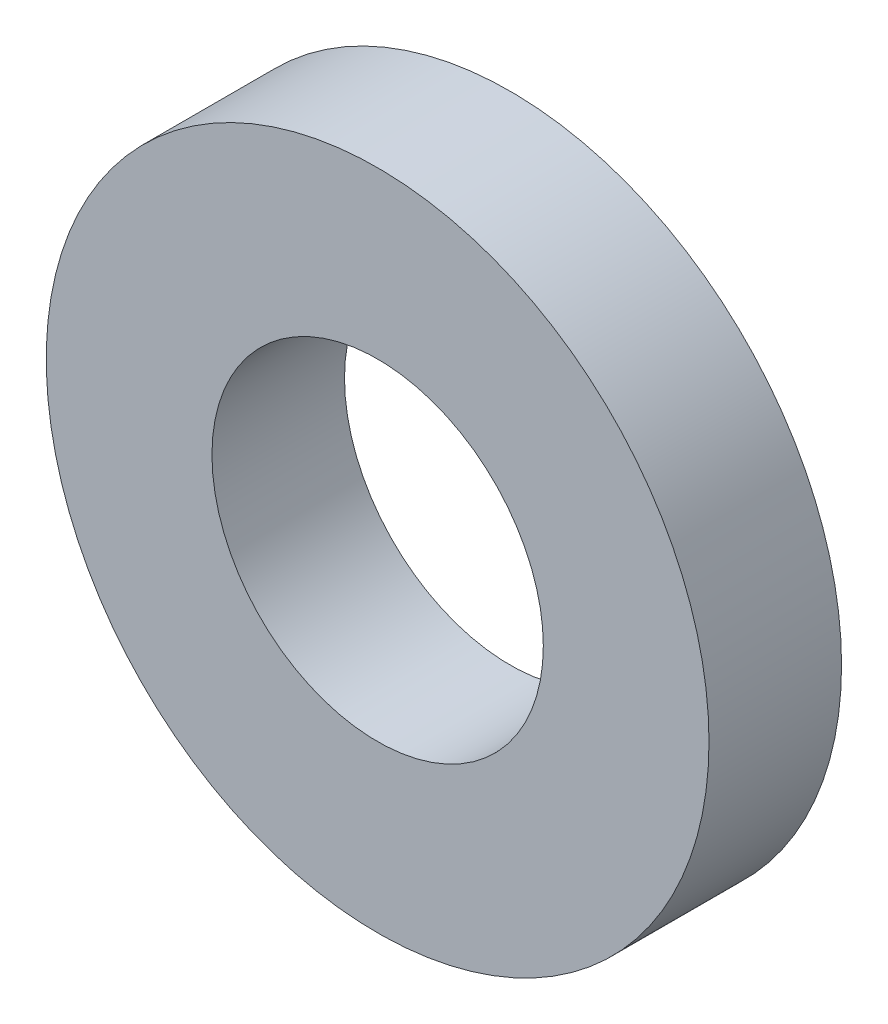
ISO-10303-21;
HEADER;
FILE_DESCRIPTION(('STEP AP214'),'2;1');
FILE_NAME('part.step','',(''),(''),'','','');
FILE_SCHEMA(('AUTOMOTIVE_DESIGN { 1 0 10303 214 1 1 1 1 }'));
ENDSEC;
DATA;
#1=APPLICATION_CONTEXT('core data for automotive mechanical design processes');
#2=APPLICATION_PROTOCOL_DEFINITION('international standard','automotive_design',2000,#1);
#3=PRODUCT_CONTEXT('',#1,'mechanical');
#4=PRODUCT('Part','Part','',(#3));
#5=PRODUCT_RELATED_PRODUCT_CATEGORY('part','',(#4));
#6=PRODUCT_DEFINITION_FORMATION('','',#4);
#7=PRODUCT_DEFINITION_CONTEXT('part definition',#1,'design');
#8=PRODUCT_DEFINITION('design','',#6,#7);
#9=PRODUCT_DEFINITION_SHAPE('','',#8);
#10=(LENGTH_UNIT() NAMED_UNIT(*) SI_UNIT(.MILLI.,.METRE.));
#11=(NAMED_UNIT(*) PLANE_ANGLE_UNIT() SI_UNIT($,.RADIAN.));
#12=(NAMED_UNIT(*) SI_UNIT($,.STERADIAN.) SOLID_ANGLE_UNIT());
#13=UNCERTAINTY_MEASURE_WITH_UNIT(LENGTH_MEASURE(1.E-05),#10,'distance_accuracy_value','');
#14=(GEOMETRIC_REPRESENTATION_CONTEXT(3) GLOBAL_UNCERTAINTY_ASSIGNED_CONTEXT((#13)) GLOBAL_UNIT_ASSIGNED_CONTEXT((#10,
#11,#12)) REPRESENTATION_CONTEXT('',''));
#15=CARTESIAN_POINT('',(0.,0.,0.));
#16=DIRECTION('',(0.,0.,1.));
#17=DIRECTION('',(1.,0.,0.));
#18=AXIS2_PLACEMENT_3D('',#15,#16,#17);
#19=CARTESIAN_POINT('',(0.,0.,1.));
#20=DIRECTION('',(0.,0.,1.));
#21=DIRECTION('',(1.,0.,0.));
#22=AXIS2_PLACEMENT_3D('',#19,#20,#21);
#23=PLANE('',#22);
#24=CARTESIAN_POINT('',(0.,0.,1.));
#25=DIRECTION('',(0.,0.,1.));
#26=DIRECTION('',(1.,0.,0.));
#27=AXIS2_PLACEMENT_3D('',#24,#25,#26);
#28=CIRCLE('',#27,2.5);
#29=CARTESIAN_POINT('',(2.5,0.,1.));
#30=VERTEX_POINT('',#29);
#31=EDGE_CURVE('E10',#30,#30,#28,.T.);
#32=ORIENTED_EDGE('',*,*,#31,.T.);
#33=EDGE_LOOP('',(#32));
#34=FACE_BOUND('',#33,.T.);
#35=CARTESIAN_POINT('',(0.,0.,1.));
#36=DIRECTION('',(0.,0.,1.));
#37=DIRECTION('',(1.,0.,0.));
#38=AXIS2_PLACEMENT_3D('',#35,#36,#37);
#39=CIRCLE('',#38,1.25);
#40=CARTESIAN_POINT('',(1.25,0.,1.));
#41=VERTEX_POINT('',#40);
#42=EDGE_CURVE('E50',#41,#41,#39,.T.);
#43=ORIENTED_EDGE('',*,*,#42,.F.);
#44=EDGE_LOOP('',(#43));
#45=FACE_BOUND('',#44,.T.);
#46=ADVANCED_FACE('F37',(#34,#45),#23,.T.);
#47=CARTESIAN_POINT('',(0.,0.,0.));
#48=DIRECTION('',(0.,0.,1.));
#49=DIRECTION('',(1.,0.,0.));
#50=AXIS2_PLACEMENT_3D('',#47,#48,#49);
#51=PLANE('',#50);
#52=CARTESIAN_POINT('',(0.,0.,0.));
#53=DIRECTION('',(0.,0.,1.));
#54=DIRECTION('',(1.,0.,0.));
#55=AXIS2_PLACEMENT_3D('',#52,#53,#54);
#56=CIRCLE('',#55,2.5);
#57=CARTESIAN_POINT('',(2.5,0.,0.));
#58=VERTEX_POINT('',#57);
#59=EDGE_CURVE('E41',#58,#58,#56,.T.);
#60=ORIENTED_EDGE('',*,*,#59,.F.);
#61=EDGE_LOOP('',(#60));
#62=FACE_BOUND('',#61,.T.);
#63=CARTESIAN_POINT('',(0.,0.,0.));
#64=DIRECTION('',(0.,0.,1.));
#65=DIRECTION('',(1.,0.,0.));
#66=AXIS2_PLACEMENT_3D('',#63,#64,#65);
#67=CIRCLE('',#66,1.25);
#68=CARTESIAN_POINT('',(1.25,0.,0.));
#69=VERTEX_POINT('',#68);
#70=EDGE_CURVE('E52',#69,#69,#67,.T.);
#71=ORIENTED_EDGE('',*,*,#70,.T.);
#72=EDGE_LOOP('',(#71));
#73=FACE_BOUND('',#72,.T.);
#74=ADVANCED_FACE('F64',(#62,#73),#51,.F.);
#75=CARTESIAN_POINT('',(0.,0.,1.));
#76=DIRECTION('',(0.,0.,-1.));
#77=DIRECTION('',(-1.,0.,0.));
#78=AXIS2_PLACEMENT_3D('',#75,#76,#77);
#79=CYLINDRICAL_SURFACE('',#78,2.5);
#80=ORIENTED_EDGE('',*,*,#31,.F.);
#81=EDGE_LOOP('',(#80));
#82=FACE_BOUND('',#81,.T.);
#83=ORIENTED_EDGE('',*,*,#59,.T.);
#84=EDGE_LOOP('',(#83));
#85=FACE_BOUND('',#84,.T.);
#86=ADVANCED_FACE('F39',(#82,#85),#79,.T.);
#87=CARTESIAN_POINT('',(0.,0.,1.));
#88=DIRECTION('',(0.,0.,-1.));
#89=DIRECTION('',(-1.,0.,0.));
#90=AXIS2_PLACEMENT_3D('',#87,#88,#89);
#91=CYLINDRICAL_SURFACE('',#90,1.25);
#92=ORIENTED_EDGE('',*,*,#42,.T.);
#93=EDGE_LOOP('',(#92));
#94=FACE_BOUND('',#93,.T.);
#95=ORIENTED_EDGE('',*,*,#70,.F.);
#96=EDGE_LOOP('',(#95));
#97=FACE_BOUND('',#96,.T.);
#98=ADVANCED_FACE('F60',(#94,#97),#91,.F.);
#99=CLOSED_SHELL('',(#46,#74,#86,#98));
#100=MANIFOLD_SOLID_BREP('B2',#99);
#101=ADVANCED_BREP_SHAPE_REPRESENTATION('',(#18,#100),#14);
#102=SHAPE_DEFINITION_REPRESENTATION(#9,#101);
ENDSEC;
END-ISO-10303-21;
